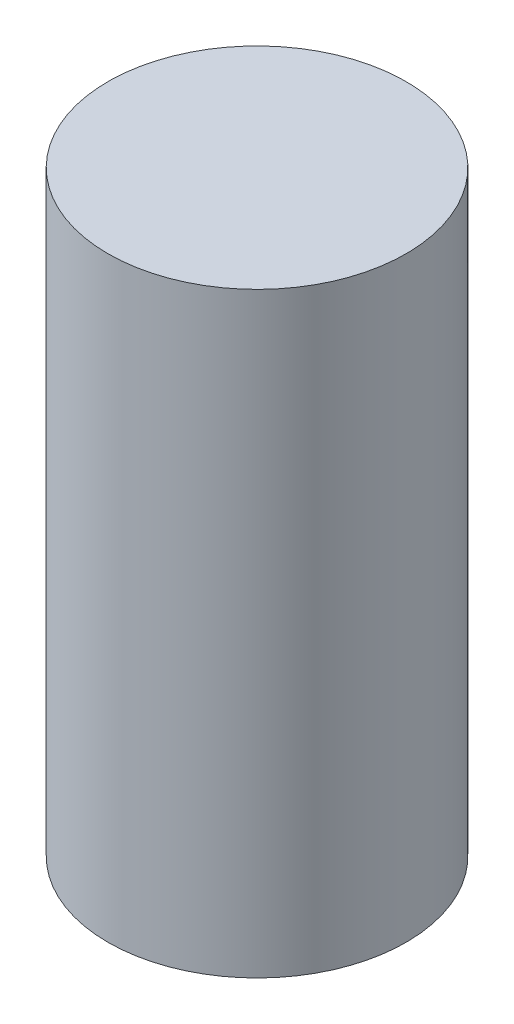
ISO-10303-21;
HEADER;
FILE_DESCRIPTION(('STEP AP214'),'2;1');
FILE_NAME('part.step','',(''),(''),'','','');
FILE_SCHEMA(('AUTOMOTIVE_DESIGN { 1 0 10303 214 1 1 1 1 }'));
ENDSEC;
DATA;
#1=APPLICATION_CONTEXT('core data for automotive mechanical design processes');
#2=APPLICATION_PROTOCOL_DEFINITION('international standard','automotive_design',2000,#1);
#3=PRODUCT_CONTEXT('',#1,'mechanical');
#4=PRODUCT('Part','Part','',(#3));
#5=PRODUCT_RELATED_PRODUCT_CATEGORY('part','',(#4));
#6=PRODUCT_DEFINITION_FORMATION('','',#4);
#7=PRODUCT_DEFINITION_CONTEXT('part definition',#1,'design');
#8=PRODUCT_DEFINITION('design','',#6,#7);
#9=PRODUCT_DEFINITION_SHAPE('','',#8);
#10=(LENGTH_UNIT() NAMED_UNIT(*) SI_UNIT(.MILLI.,.METRE.));
#11=(NAMED_UNIT(*) PLANE_ANGLE_UNIT() SI_UNIT($,.RADIAN.));
#12=(NAMED_UNIT(*) SI_UNIT($,.STERADIAN.) SOLID_ANGLE_UNIT());
#13=UNCERTAINTY_MEASURE_WITH_UNIT(LENGTH_MEASURE(1.E-05),#10,'distance_accuracy_value','');
#14=(GEOMETRIC_REPRESENTATION_CONTEXT(3) GLOBAL_UNCERTAINTY_ASSIGNED_CONTEXT((#13)) GLOBAL_UNIT_ASSIGNED_CONTEXT((#10,
#11,#12)) REPRESENTATION_CONTEXT('',''));
#15=CARTESIAN_POINT('',(0.,0.,0.));
#16=DIRECTION('',(0.,0.,1.));
#17=DIRECTION('',(1.,0.,0.));
#18=AXIS2_PLACEMENT_3D('',#15,#16,#17);
#19=CARTESIAN_POINT('',(0.,6.35,0.));
#20=DIRECTION('',(0.,-1.,0.));
#21=DIRECTION('',(0.,0.,-1.));
#22=AXIS2_PLACEMENT_3D('',#19,#20,#21);
#23=CYLINDRICAL_SURFACE('',#22,1.5875);
#24=CARTESIAN_POINT('',(0.,6.35,0.));
#25=DIRECTION('',(0.,1.,0.));
#26=DIRECTION('',(0.,0.,1.));
#27=AXIS2_PLACEMENT_3D('',#24,#25,#26);
#28=CIRCLE('',#27,1.5875);
#29=CARTESIAN_POINT('',(0.,6.35,1.5875));
#30=VERTEX_POINT('',#29);
#31=EDGE_CURVE('E10',#30,#30,#28,.T.);
#32=ORIENTED_EDGE('',*,*,#31,.F.);
#33=EDGE_LOOP('',(#32));
#34=FACE_BOUND('',#33,.T.);
#35=CARTESIAN_POINT('',(0.,0.,0.));
#36=DIRECTION('',(0.,1.,0.));
#37=DIRECTION('',(0.,0.,1.));
#38=AXIS2_PLACEMENT_3D('',#35,#36,#37);
#39=CIRCLE('',#38,1.5875);
#40=CARTESIAN_POINT('',(0.,0.,1.5875));
#41=VERTEX_POINT('',#40);
#42=EDGE_CURVE('E34',#41,#41,#39,.T.);
#43=ORIENTED_EDGE('',*,*,#42,.T.);
#44=EDGE_LOOP('',(#43));
#45=FACE_BOUND('',#44,.T.);
#46=ADVANCED_FACE('F31',(#34,#45),#23,.T.);
#47=CARTESIAN_POINT('',(0.,6.35,0.));
#48=DIRECTION('',(0.,1.,0.));
#49=DIRECTION('',(0.,0.,1.));
#50=AXIS2_PLACEMENT_3D('',#47,#48,#49);
#51=PLANE('',#50);
#52=ORIENTED_EDGE('',*,*,#31,.T.);
#53=EDGE_LOOP('',(#52));
#54=FACE_BOUND('',#53,.T.);
#55=ADVANCED_FACE('F46',(#54),#51,.T.);
#56=CARTESIAN_POINT('',(0.,0.,0.));
#57=DIRECTION('',(0.,1.,0.));
#58=DIRECTION('',(0.,0.,1.));
#59=AXIS2_PLACEMENT_3D('',#56,#57,#58);
#60=PLANE('',#59);
#61=ORIENTED_EDGE('',*,*,#42,.F.);
#62=EDGE_LOOP('',(#61));
#63=FACE_BOUND('',#62,.T.);
#64=ADVANCED_FACE('F44',(#63),#60,.F.);
#65=CLOSED_SHELL('',(#46,#55,#64));
#66=MANIFOLD_SOLID_BREP('B2',#65);
#67=ADVANCED_BREP_SHAPE_REPRESENTATION('',(#18,#66),#14);
#68=SHAPE_DEFINITION_REPRESENTATION(#9,#67);
ENDSEC;
END-ISO-10303-21;
